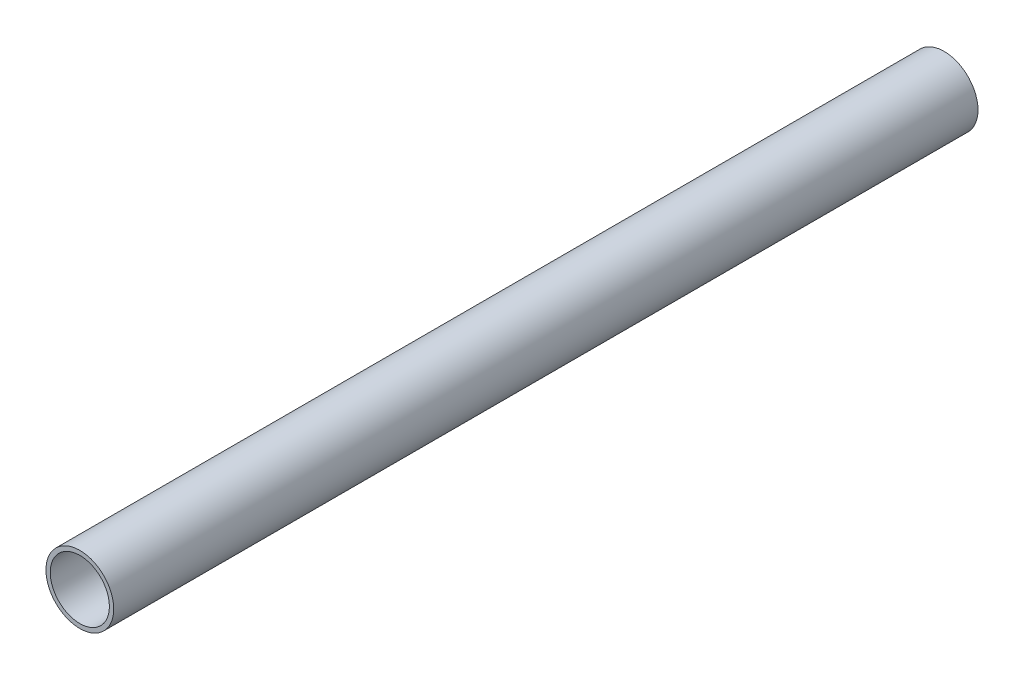
ISO-10303-21;
HEADER;
FILE_DESCRIPTION(('STEP AP214'),'2;1');
FILE_NAME('part.step','',(''),(''),'','','');
FILE_SCHEMA(('AUTOMOTIVE_DESIGN { 1 0 10303 214 1 1 1 1 }'));
ENDSEC;
DATA;
#1=APPLICATION_CONTEXT('core data for automotive mechanical design processes');
#2=APPLICATION_PROTOCOL_DEFINITION('international standard','automotive_design',2000,#1);
#3=PRODUCT_CONTEXT('',#1,'mechanical');
#4=PRODUCT('Part','Part','',(#3));
#5=PRODUCT_RELATED_PRODUCT_CATEGORY('part','',(#4));
#6=PRODUCT_DEFINITION_FORMATION('','',#4);
#7=PRODUCT_DEFINITION_CONTEXT('part definition',#1,'design');
#8=PRODUCT_DEFINITION('design','',#6,#7);
#9=PRODUCT_DEFINITION_SHAPE('','',#8);
#10=(LENGTH_UNIT() NAMED_UNIT(*) SI_UNIT(.MILLI.,.METRE.));
#11=(NAMED_UNIT(*) PLANE_ANGLE_UNIT() SI_UNIT($,.RADIAN.));
#12=(NAMED_UNIT(*) SI_UNIT($,.STERADIAN.) SOLID_ANGLE_UNIT());
#13=UNCERTAINTY_MEASURE_WITH_UNIT(LENGTH_MEASURE(1.E-05),#10,'distance_accuracy_value','');
#14=(GEOMETRIC_REPRESENTATION_CONTEXT(3) GLOBAL_UNCERTAINTY_ASSIGNED_CONTEXT((#13)) GLOBAL_UNIT_ASSIGNED_CONTEXT((#10,
#11,#12)) REPRESENTATION_CONTEXT('',''));
#15=CARTESIAN_POINT('',(0.,0.,0.));
#16=DIRECTION('',(0.,0.,1.));
#17=DIRECTION('',(1.,0.,0.));
#18=AXIS2_PLACEMENT_3D('',#15,#16,#17);
#19=CARTESIAN_POINT('',(0.,0.,482.6));
#20=DIRECTION('',(0.,0.,1.));
#21=DIRECTION('',(1.,0.,0.));
#22=AXIS2_PLACEMENT_3D('',#19,#20,#21);
#23=PLANE('',#22);
#24=CARTESIAN_POINT('',(0.,0.,482.6));
#25=DIRECTION('',(0.,0.,1.));
#26=DIRECTION('',(1.,0.,0.));
#27=AXIS2_PLACEMENT_3D('',#24,#25,#26);
#28=CIRCLE('',#27,18.923);
#29=CARTESIAN_POINT('',(18.923,0.,482.6));
#30=VERTEX_POINT('',#29);
#31=EDGE_CURVE('E10',#30,#30,#28,.T.);
#32=ORIENTED_EDGE('',*,*,#31,.T.);
#33=EDGE_LOOP('',(#32));
#34=FACE_BOUND('',#33,.T.);
#35=CARTESIAN_POINT('',(0.,0.,482.6));
#36=DIRECTION('',(0.,0.,1.));
#37=DIRECTION('',(1.,0.,0.));
#38=AXIS2_PLACEMENT_3D('',#35,#36,#37);
#39=CIRCLE('',#38,16.51);
#40=CARTESIAN_POINT('',(16.51,0.,482.6));
#41=VERTEX_POINT('',#40);
#42=EDGE_CURVE('E42',#41,#41,#39,.T.);
#43=ORIENTED_EDGE('',*,*,#42,.F.);
#44=EDGE_LOOP('',(#43));
#45=FACE_BOUND('',#44,.T.);
#46=ADVANCED_FACE('F31',(#34,#45),#23,.T.);
#47=CARTESIAN_POINT('',(0.,0.,0.));
#48=DIRECTION('',(0.,0.,1.));
#49=DIRECTION('',(1.,0.,0.));
#50=AXIS2_PLACEMENT_3D('',#47,#48,#49);
#51=PLANE('',#50);
#52=CARTESIAN_POINT('',(0.,0.,0.));
#53=DIRECTION('',(0.,0.,1.));
#54=DIRECTION('',(1.,0.,0.));
#55=AXIS2_PLACEMENT_3D('',#52,#53,#54);
#56=CIRCLE('',#55,18.923);
#57=CARTESIAN_POINT('',(18.923,0.,0.));
#58=VERTEX_POINT('',#57);
#59=EDGE_CURVE('E35',#58,#58,#56,.T.);
#60=ORIENTED_EDGE('',*,*,#59,.F.);
#61=EDGE_LOOP('',(#60));
#62=FACE_BOUND('',#61,.T.);
#63=CARTESIAN_POINT('',(0.,0.,0.));
#64=DIRECTION('',(0.,0.,1.));
#65=DIRECTION('',(1.,0.,0.));
#66=AXIS2_PLACEMENT_3D('',#63,#64,#65);
#67=CIRCLE('',#66,16.51);
#68=CARTESIAN_POINT('',(16.51,0.,0.));
#69=VERTEX_POINT('',#68);
#70=EDGE_CURVE('E44',#69,#69,#67,.T.);
#71=ORIENTED_EDGE('',*,*,#70,.T.);
#72=EDGE_LOOP('',(#71));
#73=FACE_BOUND('',#72,.T.);
#74=ADVANCED_FACE('F54',(#62,#73),#51,.F.);
#75=CARTESIAN_POINT('',(0.,0.,482.6));
#76=DIRECTION('',(0.,0.,-1.));
#77=DIRECTION('',(-1.,0.,0.));
#78=AXIS2_PLACEMENT_3D('',#75,#76,#77);
#79=CYLINDRICAL_SURFACE('',#78,18.923);
#80=ORIENTED_EDGE('',*,*,#31,.F.);
#81=EDGE_LOOP('',(#80));
#82=FACE_BOUND('',#81,.T.);
#83=ORIENTED_EDGE('',*,*,#59,.T.);
#84=EDGE_LOOP('',(#83));
#85=FACE_BOUND('',#84,.T.);
#86=ADVANCED_FACE('F33',(#82,#85),#79,.T.);
#87=CARTESIAN_POINT('',(0.,0.,482.6));
#88=DIRECTION('',(0.,0.,-1.));
#89=DIRECTION('',(-1.,0.,0.));
#90=AXIS2_PLACEMENT_3D('',#87,#88,#89);
#91=CYLINDRICAL_SURFACE('',#90,16.51);
#92=ORIENTED_EDGE('',*,*,#42,.T.);
#93=EDGE_LOOP('',(#92));
#94=FACE_BOUND('',#93,.T.);
#95=ORIENTED_EDGE('',*,*,#70,.F.);
#96=EDGE_LOOP('',(#95));
#97=FACE_BOUND('',#96,.T.);
#98=ADVANCED_FACE('F50',(#94,#97),#91,.F.);
#99=CLOSED_SHELL('',(#46,#74,#86,#98));
#100=MANIFOLD_SOLID_BREP('B2',#99);
#101=ADVANCED_BREP_SHAPE_REPRESENTATION('',(#18,#100),#14);
#102=SHAPE_DEFINITION_REPRESENTATION(#9,#101);
ENDSEC;
END-ISO-10303-21;
